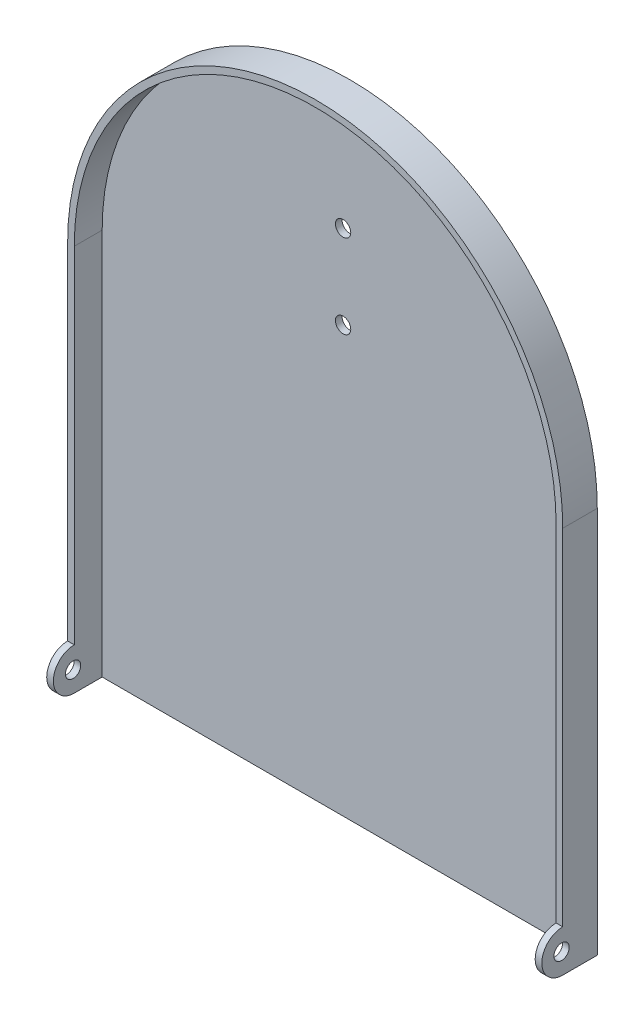
ISO-10303-21;
HEADER;
FILE_DESCRIPTION(('STEP AP214'),'2;1');
FILE_NAME('part.step','',(''),(''),'','','');
FILE_SCHEMA(('AUTOMOTIVE_DESIGN { 1 0 10303 214 1 1 1 1 }'));
ENDSEC;
DATA;
#1=APPLICATION_CONTEXT('core data for automotive mechanical design processes');
#2=APPLICATION_PROTOCOL_DEFINITION('international standard','automotive_design',2000,#1);
#3=PRODUCT_CONTEXT('',#1,'mechanical');
#4=PRODUCT('Part','Part','',(#3));
#5=PRODUCT_RELATED_PRODUCT_CATEGORY('part','',(#4));
#6=PRODUCT_DEFINITION_FORMATION('','',#4);
#7=PRODUCT_DEFINITION_CONTEXT('part definition',#1,'design');
#8=PRODUCT_DEFINITION('design','',#6,#7);
#9=PRODUCT_DEFINITION_SHAPE('','',#8);
#10=(LENGTH_UNIT() NAMED_UNIT(*) SI_UNIT(.MILLI.,.METRE.));
#11=(NAMED_UNIT(*) PLANE_ANGLE_UNIT() SI_UNIT($,.RADIAN.));
#12=(NAMED_UNIT(*) SI_UNIT($,.STERADIAN.) SOLID_ANGLE_UNIT());
#13=UNCERTAINTY_MEASURE_WITH_UNIT(LENGTH_MEASURE(1.E-05),#10,'distance_accuracy_value','');
#14=(GEOMETRIC_REPRESENTATION_CONTEXT(3) GLOBAL_UNCERTAINTY_ASSIGNED_CONTEXT((#13)) GLOBAL_UNIT_ASSIGNED_CONTEXT((#10,
#11,#12)) REPRESENTATION_CONTEXT('',''));
#15=CARTESIAN_POINT('',(0.,0.,0.));
#16=DIRECTION('',(0.,0.,1.));
#17=DIRECTION('',(1.,0.,0.));
#18=AXIS2_PLACEMENT_3D('',#15,#16,#17);
#19=CARTESIAN_POINT('',(0.,0.,2.38));
#20=DIRECTION('',(0.,1.,0.));
#21=DIRECTION('',(-1.,0.,0.));
#22=AXIS2_PLACEMENT_3D('',#19,#20,#21);
#23=PLANE('',#22);
#24=DIRECTION('',(1.,0.,0.));
#25=VECTOR('',#24,1.);
#26=CARTESIAN_POINT('',(0.,0.,0.));
#27=LINE('',#26,#25);
#28=CARTESIAN_POINT('',(0.,0.,0.));
#29=VERTEX_POINT('',#28);
#30=CARTESIAN_POINT('',(177.5,0.,0.));
#31=VERTEX_POINT('',#30);
#32=EDGE_CURVE('E182',#29,#31,#27,.T.);
#33=ORIENTED_EDGE('',*,*,#32,.T.);
#34=DIRECTION('',(0.,0.,-1.));
#35=VECTOR('',#34,1.);
#36=CARTESIAN_POINT('',(177.5,0.,2.38));
#37=LINE('',#36,#35);
#38=CARTESIAN_POINT('',(177.5,0.,12.38));
#39=VERTEX_POINT('',#38);
#40=EDGE_CURVE('E11',#39,#31,#37,.T.);
#41=ORIENTED_EDGE('',*,*,#40,.F.);
#42=DIRECTION('',(1.,0.,0.));
#43=VECTOR('',#42,1.);
#44=CARTESIAN_POINT('',(175.12,0.,12.38));
#45=LINE('',#44,#43);
#46=CARTESIAN_POINT('',(175.12,0.,12.38));
#47=VERTEX_POINT('',#46);
#48=EDGE_CURVE('E157',#47,#39,#45,.T.);
#49=ORIENTED_EDGE('',*,*,#48,.F.);
#50=DIRECTION('',(0.,0.,-1.));
#51=VECTOR('',#50,1.);
#52=CARTESIAN_POINT('',(175.12,0.,12.38));
#53=LINE('',#52,#51);
#54=CARTESIAN_POINT('',(175.12,0.,2.38));
#55=VERTEX_POINT('',#54);
#56=EDGE_CURVE('E165',#47,#55,#53,.T.);
#57=ORIENTED_EDGE('',*,*,#56,.T.);
#58=DIRECTION('',(1.,0.,0.));
#59=VECTOR('',#58,1.);
#60=CARTESIAN_POINT('',(0.,0.,2.38));
#61=LINE('',#60,#59);
#62=CARTESIAN_POINT('',(2.37999999999998,0.,2.38));
#63=VERTEX_POINT('',#62);
#64=EDGE_CURVE('E131',#63,#55,#61,.T.);
#65=ORIENTED_EDGE('',*,*,#64,.F.);
#66=DIRECTION('',(0.,0.,-1.));
#67=VECTOR('',#66,1.);
#68=CARTESIAN_POINT('',(2.38,0.,12.38));
#69=LINE('',#68,#67);
#70=CARTESIAN_POINT('',(2.38,0.,12.38));
#71=VERTEX_POINT('',#70);
#72=EDGE_CURVE('E115',#71,#63,#69,.T.);
#73=ORIENTED_EDGE('',*,*,#72,.F.);
#74=DIRECTION('',(1.,0.,0.));
#75=VECTOR('',#74,1.);
#76=CARTESIAN_POINT('',(0.,0.,12.38));
#77=LINE('',#76,#75);
#78=CARTESIAN_POINT('',(0.,0.,12.38));
#79=VERTEX_POINT('',#78);
#80=EDGE_CURVE('E108',#79,#71,#77,.T.);
#81=ORIENTED_EDGE('',*,*,#80,.F.);
#82=DIRECTION('',(0.,0.,-1.));
#83=VECTOR('',#82,1.);
#84=CARTESIAN_POINT('',(0.,0.,2.38));
#85=LINE('',#84,#83);
#86=EDGE_CURVE('E111',#79,#29,#85,.T.);
#87=ORIENTED_EDGE('',*,*,#86,.T.);
#88=EDGE_LOOP('',(#33,#41,#49,#57,#65,#73,#81,#87));
#89=FACE_BOUND('',#88,.T.);
#90=ADVANCED_FACE('F33',(#89),#23,.F.);
#91=CARTESIAN_POINT('',(177.5,0.,2.38));
#92=DIRECTION('',(-1.,0.,0.));
#93=DIRECTION('',(0.,0.,1.));
#94=AXIS2_PLACEMENT_3D('',#91,#92,#93);
#95=PLANE('',#94);
#96=CARTESIAN_POINT('',(177.5,7.48512317682383,12.8079180226475));
#97=DIRECTION('',(-1.,0.,0.));
#98=DIRECTION('',(0.,-1.,0.));
#99=AXIS2_PLACEMENT_3D('',#96,#97,#98);
#100=CIRCLE('',#99,2.75);
#101=CARTESIAN_POINT('',(177.5,4.73512317682383,12.8079180226475));
#102=VERTEX_POINT('',#101);
#103=EDGE_CURVE('E247',#102,#102,#100,.T.);
#104=ORIENTED_EDGE('',*,*,#103,.T.);
#105=EDGE_LOOP('',(#104));
#106=FACE_BOUND('',#105,.T.);
#107=DIRECTION('',(0.,1.,0.));
#108=VECTOR('',#107,1.);
#109=CARTESIAN_POINT('',(177.5,0.,0.));
#110=LINE('',#109,#108);
#111=CARTESIAN_POINT('',(177.5,138.75,0.));
#112=VERTEX_POINT('',#111);
#113=EDGE_CURVE('E185',#31,#112,#110,.T.);
#114=ORIENTED_EDGE('',*,*,#113,.T.);
#115=DIRECTION('',(0.,0.,-1.));
#116=VECTOR('',#115,1.);
#117=CARTESIAN_POINT('',(177.5,138.75,2.38));
#118=LINE('',#117,#116);
#119=CARTESIAN_POINT('',(177.5,138.75,12.38));
#120=VERTEX_POINT('',#119);
#121=EDGE_CURVE('E41',#120,#112,#118,.T.);
#122=ORIENTED_EDGE('',*,*,#121,.F.);
#123=DIRECTION('',(0.,1.,0.));
#124=VECTOR('',#123,1.);
#125=CARTESIAN_POINT('',(177.5,0.,12.38));
#126=LINE('',#125,#124);
#127=CARTESIAN_POINT('',(177.5,15.,12.38));
#128=VERTEX_POINT('',#127);
#129=EDGE_CURVE('E160',#128,#120,#126,.T.);
#130=ORIENTED_EDGE('',*,*,#129,.F.);
#131=CARTESIAN_POINT('',(177.5,7.50000000000001,12.38));
#132=DIRECTION('',(1.,0.,0.));
#133=DIRECTION('',(0.,0.,-1.));
#134=AXIS2_PLACEMENT_3D('',#131,#132,#133);
#135=CIRCLE('',#134,7.5);
#136=EDGE_CURVE('E142',#128,#39,#135,.T.);
#137=ORIENTED_EDGE('',*,*,#136,.T.);
#138=ORIENTED_EDGE('',*,*,#40,.T.);
#139=EDGE_LOOP('',(#114,#122,#130,#137,#138));
#140=FACE_BOUND('',#139,.T.);
#141=ADVANCED_FACE('F207',(#106,#140),#95,.F.);
#142=CARTESIAN_POINT('',(88.75,138.75,2.38));
#143=DIRECTION('',(0.,0.,-1.));
#144=DIRECTION('',(-1.,0.,0.));
#145=AXIS2_PLACEMENT_3D('',#142,#143,#144);
#146=CYLINDRICAL_SURFACE('',#145,88.75);
#147=CARTESIAN_POINT('',(88.75,138.75,0.));
#148=DIRECTION('',(0.,0.,1.));
#149=DIRECTION('',(1.,0.,0.));
#150=AXIS2_PLACEMENT_3D('',#147,#148,#149);
#151=CIRCLE('',#150,88.75);
#152=CARTESIAN_POINT('',(0.,138.75,0.));
#153=VERTEX_POINT('',#152);
#154=EDGE_CURVE('E187',#112,#153,#151,.T.);
#155=ORIENTED_EDGE('',*,*,#154,.T.);
#156=DIRECTION('',(0.,0.,-1.));
#157=VECTOR('',#156,1.);
#158=CARTESIAN_POINT('',(0.,138.75,2.38));
#159=LINE('',#158,#157);
#160=CARTESIAN_POINT('',(0.,138.75,12.38));
#161=VERTEX_POINT('',#160);
#162=EDGE_CURVE('E130',#161,#153,#159,.T.);
#163=ORIENTED_EDGE('',*,*,#162,.F.);
#164=CARTESIAN_POINT('',(88.75,138.75,12.38));
#165=DIRECTION('',(0.,0.,1.));
#166=DIRECTION('',(1.,0.,0.));
#167=AXIS2_PLACEMENT_3D('',#164,#165,#166);
#168=CIRCLE('',#167,88.75);
#169=EDGE_CURVE('E162',#120,#161,#168,.T.);
#170=ORIENTED_EDGE('',*,*,#169,.F.);
#171=ORIENTED_EDGE('',*,*,#121,.T.);
#172=EDGE_LOOP('',(#155,#163,#170,#171));
#173=FACE_BOUND('',#172,.T.);
#174=ADVANCED_FACE('F197',(#173),#146,.T.);
#175=CARTESIAN_POINT('',(0.,0.,2.38));
#176=DIRECTION('',(-1.,0.,0.));
#177=DIRECTION('',(0.,-1.,0.));
#178=AXIS2_PLACEMENT_3D('',#175,#176,#177);
#179=PLANE('',#178);
#180=CARTESIAN_POINT('',(0.,7.48512317682379,12.8079180226475));
#181=DIRECTION('',(-1.,0.,0.));
#182=DIRECTION('',(0.,-1.,0.));
#183=AXIS2_PLACEMENT_3D('',#180,#181,#182);
#184=CIRCLE('',#183,2.75);
#185=CARTESIAN_POINT('',(0.,4.7351231768238,12.8079180226475));
#186=VERTEX_POINT('',#185);
#187=EDGE_CURVE('E249',#186,#186,#184,.T.);
#188=ORIENTED_EDGE('',*,*,#187,.F.);
#189=EDGE_LOOP('',(#188));
#190=FACE_BOUND('',#189,.T.);
#191=DIRECTION('',(0.,1.,0.));
#192=VECTOR('',#191,1.);
#193=CARTESIAN_POINT('',(0.,0.,0.));
#194=LINE('',#193,#192);
#195=EDGE_CURVE('E129',#29,#153,#194,.T.);
#196=ORIENTED_EDGE('',*,*,#195,.F.);
#197=ORIENTED_EDGE('',*,*,#86,.F.);
#198=CARTESIAN_POINT('',(0.,7.49999999999998,12.38));
#199=DIRECTION('',(-1.,0.,0.));
#200=DIRECTION('',(0.,-1.,0.));
#201=AXIS2_PLACEMENT_3D('',#198,#199,#200);
#202=CIRCLE('',#201,7.5);
#203=CARTESIAN_POINT('',(0.,15.,12.38));
#204=VERTEX_POINT('',#203);
#205=EDGE_CURVE('E127',#79,#204,#202,.T.);
#206=ORIENTED_EDGE('',*,*,#205,.T.);
#207=DIRECTION('',(0.,-1.,0.));
#208=VECTOR('',#207,1.);
#209=CARTESIAN_POINT('',(0.,0.,12.38));
#210=LINE('',#209,#208);
#211=EDGE_CURVE('E53',#161,#204,#210,.T.);
#212=ORIENTED_EDGE('',*,*,#211,.F.);
#213=ORIENTED_EDGE('',*,*,#162,.T.);
#214=EDGE_LOOP('',(#196,#197,#206,#212,#213));
#215=FACE_BOUND('',#214,.T.);
#216=ADVANCED_FACE('F126',(#190,#215),#179,.T.);
#217=CARTESIAN_POINT('',(88.75,138.75,2.38));
#218=DIRECTION('',(0.,0.,1.));
#219=DIRECTION('',(1.,0.,0.));
#220=AXIS2_PLACEMENT_3D('',#217,#218,#219);
#221=PLANE('',#220);
#222=CARTESIAN_POINT('',(88.75,182.5,2.38));
#223=DIRECTION('',(0.,0.,1.));
#224=DIRECTION('',(1.,0.,0.));
#225=AXIS2_PLACEMENT_3D('',#222,#223,#224);
#226=CIRCLE('',#225,2.75000000000001);
#227=CARTESIAN_POINT('',(91.5,182.5,2.38));
#228=VERTEX_POINT('',#227);
#229=EDGE_CURVE('E253',#228,#228,#226,.T.);
#230=ORIENTED_EDGE('',*,*,#229,.F.);
#231=EDGE_LOOP('',(#230));
#232=FACE_BOUND('',#231,.T.);
#233=CARTESIAN_POINT('',(88.75,152.5,2.38));
#234=DIRECTION('',(0.,0.,1.));
#235=DIRECTION('',(1.,0.,0.));
#236=AXIS2_PLACEMENT_3D('',#233,#234,#235);
#237=CIRCLE('',#236,2.75000000000001);
#238=CARTESIAN_POINT('',(91.5,152.5,2.38));
#239=VERTEX_POINT('',#238);
#240=EDGE_CURVE('E258',#239,#239,#237,.T.);
#241=ORIENTED_EDGE('',*,*,#240,.F.);
#242=EDGE_LOOP('',(#241));
#243=FACE_BOUND('',#242,.T.);
#244=DIRECTION('',(0.,-1.,0.));
#245=VECTOR('',#244,1.);
#246=CARTESIAN_POINT('',(175.12,2.38000000000001,2.38));
#247=LINE('',#246,#245);
#248=CARTESIAN_POINT('',(175.12,138.75,2.38));
#249=VERTEX_POINT('',#248);
#250=EDGE_CURVE('E121',#249,#55,#247,.T.);
#251=ORIENTED_EDGE('',*,*,#250,.F.);
#252=CARTESIAN_POINT('',(88.75,138.75,2.38));
#253=DIRECTION('',(0.,0.,-1.));
#254=DIRECTION('',(1.,0.,0.));
#255=AXIS2_PLACEMENT_3D('',#252,#253,#254);
#256=CIRCLE('',#255,86.37);
#257=CARTESIAN_POINT('',(2.37999999999997,138.75,2.38));
#258=VERTEX_POINT('',#257);
#259=EDGE_CURVE('E168',#258,#249,#256,.T.);
#260=ORIENTED_EDGE('',*,*,#259,.F.);
#261=DIRECTION('',(0.,1.,0.));
#262=VECTOR('',#261,1.);
#263=CARTESIAN_POINT('',(2.37999999999997,138.75,2.38));
#264=LINE('',#263,#262);
#265=EDGE_CURVE('E150',#63,#258,#264,.T.);
#266=ORIENTED_EDGE('',*,*,#265,.F.);
#267=ORIENTED_EDGE('',*,*,#64,.T.);
#268=EDGE_LOOP('',(#251,#260,#266,#267));
#269=FACE_BOUND('',#268,.T.);
#270=ADVANCED_FACE('F220',(#232,#243,#269),#221,.T.);
#271=CARTESIAN_POINT('',(88.75,138.75,0.));
#272=DIRECTION('',(0.,0.,1.));
#273=DIRECTION('',(1.,0.,0.));
#274=AXIS2_PLACEMENT_3D('',#271,#272,#273);
#275=PLANE('',#274);
#276=CARTESIAN_POINT('',(88.75,182.5,0.));
#277=DIRECTION('',(0.,0.,-1.));
#278=DIRECTION('',(-1.,0.,0.));
#279=AXIS2_PLACEMENT_3D('',#276,#277,#278);
#280=CIRCLE('',#279,2.75000000000001);
#281=CARTESIAN_POINT('',(86.,182.5,0.));
#282=VERTEX_POINT('',#281);
#283=EDGE_CURVE('E261',#282,#282,#280,.T.);
#284=ORIENTED_EDGE('',*,*,#283,.F.);
#285=EDGE_LOOP('',(#284));
#286=FACE_BOUND('',#285,.T.);
#287=CARTESIAN_POINT('',(88.75,152.5,0.));
#288=DIRECTION('',(0.,0.,-1.));
#289=DIRECTION('',(-1.,0.,0.));
#290=AXIS2_PLACEMENT_3D('',#287,#288,#289);
#291=CIRCLE('',#290,2.75000000000001);
#292=CARTESIAN_POINT('',(86.,152.5,0.));
#293=VERTEX_POINT('',#292);
#294=EDGE_CURVE('E262',#293,#293,#291,.T.);
#295=ORIENTED_EDGE('',*,*,#294,.F.);
#296=EDGE_LOOP('',(#295));
#297=FACE_BOUND('',#296,.T.);
#298=ORIENTED_EDGE('',*,*,#32,.F.);
#299=ORIENTED_EDGE('',*,*,#195,.T.);
#300=ORIENTED_EDGE('',*,*,#154,.F.);
#301=ORIENTED_EDGE('',*,*,#113,.F.);
#302=EDGE_LOOP('',(#298,#299,#300,#301));
#303=FACE_BOUND('',#302,.T.);
#304=ADVANCED_FACE('F200',(#286,#297,#303),#275,.F.);
#305=CARTESIAN_POINT('',(2.37999999999997,138.75,12.38));
#306=DIRECTION('',(-1.,0.,0.));
#307=DIRECTION('',(0.,-1.,0.));
#308=AXIS2_PLACEMENT_3D('',#305,#306,#307);
#309=PLANE('',#308);
#310=CARTESIAN_POINT('',(2.37999999999999,7.48512317682379,12.8079180226475));
#311=DIRECTION('',(-1.,0.,0.));
#312=DIRECTION('',(0.,-1.,0.));
#313=AXIS2_PLACEMENT_3D('',#310,#311,#312);
#314=CIRCLE('',#313,2.75);
#315=CARTESIAN_POINT('',(2.37999999999999,4.7351231768238,12.8079180226475));
#316=VERTEX_POINT('',#315);
#317=EDGE_CURVE('E135',#316,#316,#314,.T.);
#318=ORIENTED_EDGE('',*,*,#317,.T.);
#319=EDGE_LOOP('',(#318));
#320=FACE_BOUND('',#319,.T.);
#321=ORIENTED_EDGE('',*,*,#265,.T.);
#322=DIRECTION('',(0.,0.,-1.));
#323=VECTOR('',#322,1.);
#324=CARTESIAN_POINT('',(2.37999999999997,138.75,12.38));
#325=LINE('',#324,#323);
#326=CARTESIAN_POINT('',(2.37999999999997,138.75,12.38));
#327=VERTEX_POINT('',#326);
#328=EDGE_CURVE('E178',#327,#258,#325,.T.);
#329=ORIENTED_EDGE('',*,*,#328,.F.);
#330=DIRECTION('',(0.,1.,0.));
#331=VECTOR('',#330,1.);
#332=CARTESIAN_POINT('',(2.38,2.38,12.38));
#333=LINE('',#332,#331);
#334=CARTESIAN_POINT('',(2.38,15.,12.38));
#335=VERTEX_POINT('',#334);
#336=EDGE_CURVE('E120',#335,#327,#333,.T.);
#337=ORIENTED_EDGE('',*,*,#336,.F.);
#338=CARTESIAN_POINT('',(2.38,7.49999999999998,12.38));
#339=DIRECTION('',(-1.,0.,0.));
#340=DIRECTION('',(0.,-1.,0.));
#341=AXIS2_PLACEMENT_3D('',#338,#339,#340);
#342=CIRCLE('',#341,7.5);
#343=EDGE_CURVE('E134',#71,#335,#342,.T.);
#344=ORIENTED_EDGE('',*,*,#343,.F.);
#345=ORIENTED_EDGE('',*,*,#72,.T.);
#346=EDGE_LOOP('',(#321,#329,#337,#344,#345));
#347=FACE_BOUND('',#346,.T.);
#348=ADVANCED_FACE('F214',(#320,#347),#309,.F.);
#349=CARTESIAN_POINT('',(88.75,138.75,12.38));
#350=DIRECTION('',(0.,0.,-1.));
#351=DIRECTION('',(-1.,0.,0.));
#352=AXIS2_PLACEMENT_3D('',#349,#350,#351);
#353=CYLINDRICAL_SURFACE('',#352,86.37);
#354=ORIENTED_EDGE('',*,*,#259,.T.);
#355=DIRECTION('',(0.,0.,-1.));
#356=VECTOR('',#355,1.);
#357=CARTESIAN_POINT('',(175.12,138.75,12.38));
#358=LINE('',#357,#356);
#359=CARTESIAN_POINT('',(175.12,138.75,12.38));
#360=VERTEX_POINT('',#359);
#361=EDGE_CURVE('E175',#360,#249,#358,.T.);
#362=ORIENTED_EDGE('',*,*,#361,.F.);
#363=CARTESIAN_POINT('',(88.75,138.75,12.38));
#364=DIRECTION('',(0.,0.,-1.));
#365=DIRECTION('',(1.,0.,0.));
#366=AXIS2_PLACEMENT_3D('',#363,#364,#365);
#367=CIRCLE('',#366,86.37);
#368=EDGE_CURVE('E153',#327,#360,#367,.T.);
#369=ORIENTED_EDGE('',*,*,#368,.F.);
#370=ORIENTED_EDGE('',*,*,#328,.T.);
#371=EDGE_LOOP('',(#354,#362,#369,#370));
#372=FACE_BOUND('',#371,.T.);
#373=ADVANCED_FACE('F219',(#372),#353,.F.);
#374=CARTESIAN_POINT('',(175.12,2.38000000000001,12.38));
#375=DIRECTION('',(1.,0.,0.));
#376=DIRECTION('',(0.,0.,-1.));
#377=AXIS2_PLACEMENT_3D('',#374,#375,#376);
#378=PLANE('',#377);
#379=CARTESIAN_POINT('',(175.12,7.48512317682383,12.8079180226475));
#380=DIRECTION('',(1.,0.,0.));
#381=DIRECTION('',(0.,0.,-1.));
#382=AXIS2_PLACEMENT_3D('',#379,#380,#381);
#383=CIRCLE('',#382,2.75);
#384=CARTESIAN_POINT('',(175.12,7.48512317682383,10.0579180226475));
#385=VERTEX_POINT('',#384);
#386=EDGE_CURVE('E36',#385,#385,#383,.T.);
#387=ORIENTED_EDGE('',*,*,#386,.T.);
#388=EDGE_LOOP('',(#387));
#389=FACE_BOUND('',#388,.T.);
#390=ORIENTED_EDGE('',*,*,#250,.T.);
#391=ORIENTED_EDGE('',*,*,#56,.F.);
#392=CARTESIAN_POINT('',(175.12,7.50000000000001,12.38));
#393=DIRECTION('',(1.,0.,0.));
#394=DIRECTION('',(0.,0.,-1.));
#395=AXIS2_PLACEMENT_3D('',#392,#393,#394);
#396=CIRCLE('',#395,7.5);
#397=CARTESIAN_POINT('',(175.12,15.,12.38));
#398=VERTEX_POINT('',#397);
#399=EDGE_CURVE('E143',#398,#47,#396,.T.);
#400=ORIENTED_EDGE('',*,*,#399,.F.);
#401=DIRECTION('',(0.,-1.,0.));
#402=VECTOR('',#401,1.);
#403=CARTESIAN_POINT('',(175.12,2.38000000000001,12.38));
#404=LINE('',#403,#402);
#405=EDGE_CURVE('E155',#360,#398,#404,.T.);
#406=ORIENTED_EDGE('',*,*,#405,.F.);
#407=ORIENTED_EDGE('',*,*,#361,.T.);
#408=EDGE_LOOP('',(#390,#391,#400,#406,#407));
#409=FACE_BOUND('',#408,.T.);
#410=ADVANCED_FACE('F211',(#389,#409),#378,.F.);
#411=CARTESIAN_POINT('',(88.75,138.75,12.38));
#412=DIRECTION('',(0.,0.,1.));
#413=DIRECTION('',(1.,0.,0.));
#414=AXIS2_PLACEMENT_3D('',#411,#412,#413);
#415=PLANE('',#414);
#416=DIRECTION('',(-1.,0.,0.));
#417=VECTOR('',#416,1.);
#418=CARTESIAN_POINT('',(2.38,15.,12.38));
#419=LINE('',#418,#417);
#420=EDGE_CURVE('E48',#335,#204,#419,.T.);
#421=ORIENTED_EDGE('',*,*,#420,.F.);
#422=ORIENTED_EDGE('',*,*,#336,.T.);
#423=ORIENTED_EDGE('',*,*,#368,.T.);
#424=ORIENTED_EDGE('',*,*,#405,.T.);
#425=DIRECTION('',(1.,0.,0.));
#426=VECTOR('',#425,1.);
#427=CARTESIAN_POINT('',(175.12,15.,12.38));
#428=LINE('',#427,#426);
#429=EDGE_CURVE('E146',#398,#128,#428,.T.);
#430=ORIENTED_EDGE('',*,*,#429,.T.);
#431=ORIENTED_EDGE('',*,*,#129,.T.);
#432=ORIENTED_EDGE('',*,*,#169,.T.);
#433=ORIENTED_EDGE('',*,*,#211,.T.);
#434=EDGE_LOOP('',(#421,#422,#423,#424,#430,#431,#432,#433));
#435=FACE_BOUND('',#434,.T.);
#436=ADVANCED_FACE('F208',(#435),#415,.T.);
#437=CARTESIAN_POINT('',(175.12,7.50000000000001,12.38));
#438=DIRECTION('',(1.,0.,0.));
#439=DIRECTION('',(0.,0.,-1.));
#440=AXIS2_PLACEMENT_3D('',#437,#438,#439);
#441=CYLINDRICAL_SURFACE('',#440,7.5);
#442=ORIENTED_EDGE('',*,*,#136,.F.);
#443=ORIENTED_EDGE('',*,*,#429,.F.);
#444=ORIENTED_EDGE('',*,*,#399,.T.);
#445=ORIENTED_EDGE('',*,*,#48,.T.);
#446=EDGE_LOOP('',(#442,#443,#444,#445));
#447=FACE_BOUND('',#446,.T.);
#448=ADVANCED_FACE('F204',(#447),#441,.T.);
#449=CARTESIAN_POINT('',(2.38,7.49999999999998,12.38));
#450=DIRECTION('',(-1.,0.,0.));
#451=DIRECTION('',(0.,-1.,0.));
#452=AXIS2_PLACEMENT_3D('',#449,#450,#451);
#453=CYLINDRICAL_SURFACE('',#452,7.5);
#454=ORIENTED_EDGE('',*,*,#205,.F.);
#455=ORIENTED_EDGE('',*,*,#80,.T.);
#456=ORIENTED_EDGE('',*,*,#343,.T.);
#457=ORIENTED_EDGE('',*,*,#420,.T.);
#458=EDGE_LOOP('',(#454,#455,#456,#457));
#459=FACE_BOUND('',#458,.T.);
#460=ADVANCED_FACE('F133',(#459),#453,.T.);
#461=CARTESIAN_POINT('',(177.5,7.48512317682383,12.8079180226475));
#462=DIRECTION('',(-1.,0.,0.));
#463=DIRECTION('',(0.,-1.,0.));
#464=AXIS2_PLACEMENT_3D('',#461,#462,#463);
#465=CYLINDRICAL_SURFACE('',#464,2.75);
#466=ORIENTED_EDGE('',*,*,#103,.F.);
#467=EDGE_LOOP('',(#466));
#468=FACE_BOUND('',#467,.T.);
#469=ORIENTED_EDGE('',*,*,#386,.F.);
#470=EDGE_LOOP('',(#469));
#471=FACE_BOUND('',#470,.T.);
#472=ADVANCED_FACE('F283',(#468,#471),#465,.F.);
#473=ORIENTED_EDGE('',*,*,#187,.T.);
#474=EDGE_LOOP('',(#473));
#475=FACE_BOUND('',#474,.T.);
#476=ORIENTED_EDGE('',*,*,#317,.F.);
#477=EDGE_LOOP('',(#476));
#478=FACE_BOUND('',#477,.T.);
#479=ADVANCED_FACE('F274',(#475,#478),#465,.F.);
#480=CARTESIAN_POINT('',(88.75,152.5,19.88));
#481=DIRECTION('',(0.,0.,-1.));
#482=DIRECTION('',(-1.,0.,0.));
#483=AXIS2_PLACEMENT_3D('',#480,#481,#482);
#484=CYLINDRICAL_SURFACE('',#483,2.75000000000001);
#485=ORIENTED_EDGE('',*,*,#240,.T.);
#486=EDGE_LOOP('',(#485));
#487=FACE_BOUND('',#486,.T.);
#488=ORIENTED_EDGE('',*,*,#294,.T.);
#489=EDGE_LOOP('',(#488));
#490=FACE_BOUND('',#489,.T.);
#491=ADVANCED_FACE('F272',(#487,#490),#484,.F.);
#492=CARTESIAN_POINT('',(88.75,182.5,19.88));
#493=DIRECTION('',(0.,0.,-1.));
#494=DIRECTION('',(-1.,0.,0.));
#495=AXIS2_PLACEMENT_3D('',#492,#493,#494);
#496=CYLINDRICAL_SURFACE('',#495,2.75000000000001);
#497=ORIENTED_EDGE('',*,*,#229,.T.);
#498=EDGE_LOOP('',(#497));
#499=FACE_BOUND('',#498,.T.);
#500=ORIENTED_EDGE('',*,*,#283,.T.);
#501=EDGE_LOOP('',(#500));
#502=FACE_BOUND('',#501,.T.);
#503=ADVANCED_FACE('F268',(#499,#502),#496,.F.);
#504=CLOSED_SHELL('',(#90,#141,#174,#216,#270,#304,#348,#373,#410,#436,#448,#460,#472,#479,#491,#503));
#505=MANIFOLD_SOLID_BREP('B2',#504);
#506=ADVANCED_BREP_SHAPE_REPRESENTATION('',(#18,#505),#14);
#507=SHAPE_DEFINITION_REPRESENTATION(#9,#506);
ENDSEC;
END-ISO-10303-21;
